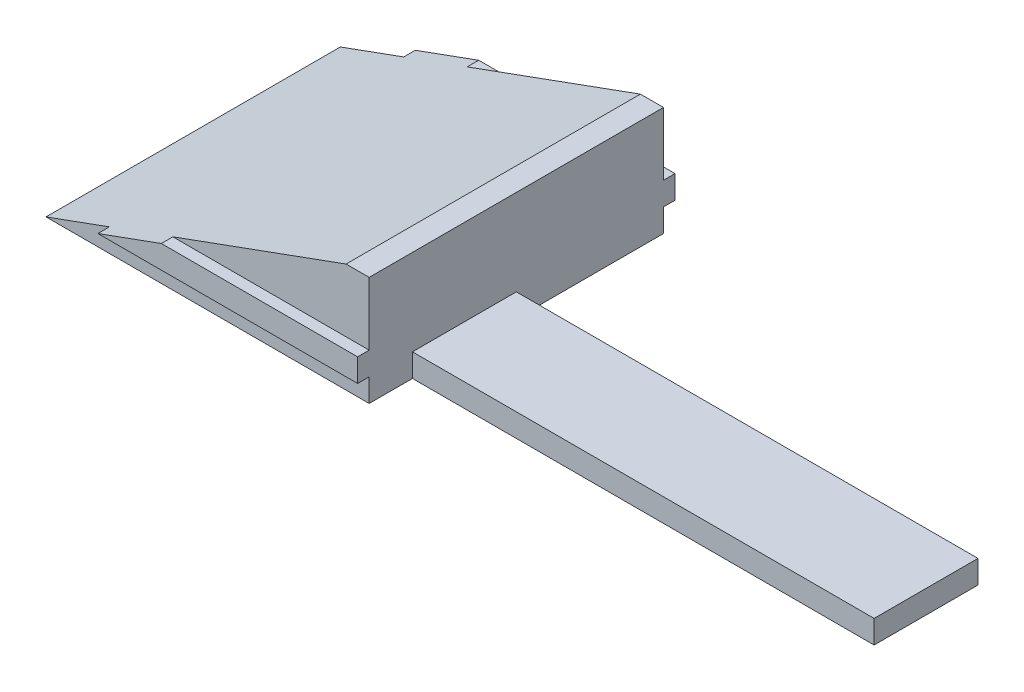
ISO-10303-21;
HEADER;
FILE_DESCRIPTION(('STEP AP214'),'2;1');
FILE_NAME('part.step','',(''),(''),'','','');
FILE_SCHEMA(('AUTOMOTIVE_DESIGN { 1 0 10303 214 1 1 1 1 }'));
ENDSEC;
DATA;
#1=APPLICATION_CONTEXT('core data for automotive mechanical design processes');
#2=APPLICATION_PROTOCOL_DEFINITION('international standard','automotive_design',2000,#1);
#3=PRODUCT_CONTEXT('',#1,'mechanical');
#4=PRODUCT('Part','Part','',(#3));
#5=PRODUCT_RELATED_PRODUCT_CATEGORY('part','',(#4));
#6=PRODUCT_DEFINITION_FORMATION('','',#4);
#7=PRODUCT_DEFINITION_CONTEXT('part definition',#1,'design');
#8=PRODUCT_DEFINITION('design','',#6,#7);
#9=PRODUCT_DEFINITION_SHAPE('','',#8);
#10=(LENGTH_UNIT() NAMED_UNIT(*) SI_UNIT(.MILLI.,.METRE.));
#11=(NAMED_UNIT(*) PLANE_ANGLE_UNIT() SI_UNIT($,.RADIAN.));
#12=(NAMED_UNIT(*) SI_UNIT($,.STERADIAN.) SOLID_ANGLE_UNIT());
#13=UNCERTAINTY_MEASURE_WITH_UNIT(LENGTH_MEASURE(1.E-05),#10,'distance_accuracy_value','');
#14=(GEOMETRIC_REPRESENTATION_CONTEXT(3) GLOBAL_UNCERTAINTY_ASSIGNED_CONTEXT((#13)) GLOBAL_UNIT_ASSIGNED_CONTEXT((#10,
#11,#12)) REPRESENTATION_CONTEXT('',''));
#15=CARTESIAN_POINT('',(0.,0.,0.));
#16=DIRECTION('',(0.,0.,1.));
#17=DIRECTION('',(1.,0.,0.));
#18=AXIS2_PLACEMENT_3D('',#15,#16,#17);
#19=CARTESIAN_POINT('',(-13.,9.463,-12.75));
#20=DIRECTION('',(0.,0.,1.));
#21=DIRECTION('',(1.,0.,0.));
#22=AXIS2_PLACEMENT_3D('',#19,#20,#21);
#23=PLANE('',#22);
#24=DIRECTION('',(1.,0.,0.));
#25=VECTOR('',#24,1.);
#26=CARTESIAN_POINT('',(13.,4.,-12.75));
#27=LINE('',#26,#25);
#28=CARTESIAN_POINT('',(-2.0100903221815,4.,-12.75));
#29=VERTEX_POINT('',#28);
#30=CARTESIAN_POINT('',(15.,4.,-12.75));
#31=VERTEX_POINT('',#30);
#32=EDGE_CURVE('E211',#29,#31,#27,.T.);
#33=ORIENTED_EDGE('',*,*,#32,.F.);
#34=DIRECTION('',(-0.939692620785908,-0.342020143325669,0.));
#35=VECTOR('',#34,1.);
#36=CARTESIAN_POINT('',(12.9993788202991,9.463,-12.75));
#37=LINE('',#36,#35);
#38=CARTESIAN_POINT('',(12.9993788202991,9.463,-12.75));
#39=VERTEX_POINT('',#38);
#40=EDGE_CURVE('E11',#29,#39,#37,.F.);
#41=ORIENTED_EDGE('',*,*,#40,.T.);
#42=DIRECTION('',(-1.,0.,0.));
#43=VECTOR('',#42,1.);
#44=CARTESIAN_POINT('',(-13.,9.463,-12.75));
#45=LINE('',#44,#43);
#46=CARTESIAN_POINT('',(15.,9.463,-12.75));
#47=VERTEX_POINT('',#46);
#48=EDGE_CURVE('E227',#47,#39,#45,.T.);
#49=ORIENTED_EDGE('',*,*,#48,.F.);
#50=DIRECTION('',(0.,1.,0.));
#51=VECTOR('',#50,1.);
#52=CARTESIAN_POINT('',(15.,4.,-12.75));
#53=LINE('',#52,#51);
#54=EDGE_CURVE('E188',#31,#47,#53,.T.);
#55=ORIENTED_EDGE('',*,*,#54,.F.);
#56=EDGE_LOOP('',(#33,#41,#49,#55));
#57=FACE_BOUND('',#56,.T.);
#58=ADVANCED_FACE('F33',(#57),#23,.F.);
#59=DIRECTION('',(-1.,0.,0.));
#60=VECTOR('',#59,1.);
#61=CARTESIAN_POINT('',(-13.,0.,-12.75));
#62=LINE('',#61,#60);
#63=CARTESIAN_POINT('',(15.,0.,-12.75));
#64=VERTEX_POINT('',#63);
#65=CARTESIAN_POINT('',(-13.,0.,-12.75));
#66=VERTEX_POINT('',#65);
#67=EDGE_CURVE('E223',#64,#66,#62,.T.);
#68=ORIENTED_EDGE('',*,*,#67,.T.);
#69=DIRECTION('',(-0.939692620785908,-0.342020143325669,0.));
#70=VECTOR('',#69,1.);
#71=CARTESIAN_POINT('',(12.9993788202991,9.463,-12.75));
#72=LINE('',#71,#70);
#73=CARTESIAN_POINT('',(-7.50504516109073,2.,-12.75));
#74=VERTEX_POINT('',#73);
#75=EDGE_CURVE('E251',#66,#74,#72,.F.);
#76=ORIENTED_EDGE('',*,*,#75,.T.);
#77=DIRECTION('',(-1.,0.,0.));
#78=VECTOR('',#77,1.);
#79=CARTESIAN_POINT('',(13.,2.,-12.75));
#80=LINE('',#79,#78);
#81=CARTESIAN_POINT('',(15.,2.,-12.75));
#82=VERTEX_POINT('',#81);
#83=EDGE_CURVE('E206',#82,#74,#80,.T.);
#84=ORIENTED_EDGE('',*,*,#83,.F.);
#85=DIRECTION('',(0.,1.,0.));
#86=VECTOR('',#85,1.);
#87=CARTESIAN_POINT('',(15.,0.,-12.75));
#88=LINE('',#87,#86);
#89=EDGE_CURVE('E176',#64,#82,#88,.T.);
#90=ORIENTED_EDGE('',*,*,#89,.F.);
#91=EDGE_LOOP('',(#68,#76,#84,#90));
#92=FACE_BOUND('',#91,.T.);
#93=ADVANCED_FACE('F322',(#92),#23,.F.);
#94=CARTESIAN_POINT('',(-13.,9.463,12.75));
#95=DIRECTION('',(0.,0.,-1.));
#96=DIRECTION('',(-1.,0.,0.));
#97=AXIS2_PLACEMENT_3D('',#94,#95,#96);
#98=PLANE('',#97);
#99=DIRECTION('',(1.,0.,0.));
#100=VECTOR('',#99,1.);
#101=CARTESIAN_POINT('',(-13.,9.463,12.75));
#102=LINE('',#101,#100);
#103=CARTESIAN_POINT('',(12.9993788202991,9.463,12.75));
#104=VERTEX_POINT('',#103);
#105=CARTESIAN_POINT('',(15.,9.463,12.75));
#106=VERTEX_POINT('',#105);
#107=EDGE_CURVE('E230',#104,#106,#102,.T.);
#108=ORIENTED_EDGE('',*,*,#107,.F.);
#109=DIRECTION('',(0.939692620785908,0.342020143325669,0.));
#110=VECTOR('',#109,1.);
#111=CARTESIAN_POINT('',(12.9993788202991,9.463,12.75));
#112=LINE('',#111,#110);
#113=CARTESIAN_POINT('',(-2.01009032218151,4.,12.75));
#114=VERTEX_POINT('',#113);
#115=EDGE_CURVE('E241',#104,#114,#112,.F.);
#116=ORIENTED_EDGE('',*,*,#115,.T.);
#117=DIRECTION('',(-1.,0.,0.));
#118=VECTOR('',#117,1.);
#119=CARTESIAN_POINT('',(-13.,4.,12.75));
#120=LINE('',#119,#118);
#121=CARTESIAN_POINT('',(15.,4.,12.75));
#122=VERTEX_POINT('',#121);
#123=EDGE_CURVE('E213',#122,#114,#120,.T.);
#124=ORIENTED_EDGE('',*,*,#123,.F.);
#125=DIRECTION('',(0.,-1.,0.));
#126=VECTOR('',#125,1.);
#127=CARTESIAN_POINT('',(15.,9.463,12.75));
#128=LINE('',#127,#126);
#129=EDGE_CURVE('E194',#106,#122,#128,.T.);
#130=ORIENTED_EDGE('',*,*,#129,.F.);
#131=EDGE_LOOP('',(#108,#116,#124,#130));
#132=FACE_BOUND('',#131,.T.);
#133=ADVANCED_FACE('F276',(#132),#98,.F.);
#134=DIRECTION('',(1.,0.,0.));
#135=VECTOR('',#134,1.);
#136=CARTESIAN_POINT('',(-13.,2.,12.75));
#137=LINE('',#136,#135);
#138=CARTESIAN_POINT('',(-7.50504516109074,2.,12.75));
#139=VERTEX_POINT('',#138);
#140=CARTESIAN_POINT('',(15.,2.,12.75));
#141=VERTEX_POINT('',#140);
#142=EDGE_CURVE('E221',#139,#141,#137,.T.);
#143=ORIENTED_EDGE('',*,*,#142,.F.);
#144=DIRECTION('',(0.939692620785908,0.342020143325669,0.));
#145=VECTOR('',#144,1.);
#146=CARTESIAN_POINT('',(12.9993788202991,9.463,12.75));
#147=LINE('',#146,#145);
#148=CARTESIAN_POINT('',(-13.,0.,12.75));
#149=VERTEX_POINT('',#148);
#150=EDGE_CURVE('E249',#139,#149,#147,.F.);
#151=ORIENTED_EDGE('',*,*,#150,.T.);
#152=DIRECTION('',(1.,0.,0.));
#153=VECTOR('',#152,1.);
#154=CARTESIAN_POINT('',(-13.,0.,12.75));
#155=LINE('',#154,#153);
#156=CARTESIAN_POINT('',(15.,0.,12.75));
#157=VERTEX_POINT('',#156);
#158=EDGE_CURVE('E231',#149,#157,#155,.T.);
#159=ORIENTED_EDGE('',*,*,#158,.T.);
#160=DIRECTION('',(0.,-1.,0.));
#161=VECTOR('',#160,1.);
#162=CARTESIAN_POINT('',(15.,2.,12.75));
#163=LINE('',#162,#161);
#164=EDGE_CURVE('E165',#141,#157,#163,.T.);
#165=ORIENTED_EDGE('',*,*,#164,.F.);
#166=EDGE_LOOP('',(#143,#151,#159,#165));
#167=FACE_BOUND('',#166,.T.);
#168=ADVANCED_FACE('F294',(#167),#98,.F.);
#169=CARTESIAN_POINT('',(0.,9.463,0.));
#170=DIRECTION('',(0.,-1.,0.));
#171=DIRECTION('',(0.,0.,-1.));
#172=AXIS2_PLACEMENT_3D('',#169,#170,#171);
#173=PLANE('',#172);
#174=ORIENTED_EDGE('',*,*,#48,.T.);
#175=DIRECTION('',(0.,0.,1.));
#176=VECTOR('',#175,1.);
#177=CARTESIAN_POINT('',(12.9993788202991,9.463,0.));
#178=LINE('',#177,#176);
#179=EDGE_CURVE('E233',#39,#104,#178,.T.);
#180=ORIENTED_EDGE('',*,*,#179,.T.);
#181=ORIENTED_EDGE('',*,*,#107,.T.);
#182=DIRECTION('',(0.,0.,1.));
#183=VECTOR('',#182,1.);
#184=CARTESIAN_POINT('',(15.,9.463,-12.75));
#185=LINE('',#184,#183);
#186=EDGE_CURVE('E191',#47,#106,#185,.T.);
#187=ORIENTED_EDGE('',*,*,#186,.F.);
#188=EDGE_LOOP('',(#174,#180,#181,#187));
#189=FACE_BOUND('',#188,.T.);
#190=ADVANCED_FACE('F272',(#189),#173,.F.);
#191=CARTESIAN_POINT('',(0.,0.,0.));
#192=DIRECTION('',(0.,-1.,0.));
#193=DIRECTION('',(0.,0.,-1.));
#194=AXIS2_PLACEMENT_3D('',#191,#192,#193);
#195=PLANE('',#194);
#196=ORIENTED_EDGE('',*,*,#67,.F.);
#197=DIRECTION('',(0.,0.,-1.));
#198=VECTOR('',#197,1.);
#199=CARTESIAN_POINT('',(15.,0.,12.75));
#200=LINE('',#199,#198);
#201=CARTESIAN_POINT('',(15.,0.,0.));
#202=VERTEX_POINT('',#201);
#203=EDGE_CURVE('E168',#202,#64,#200,.T.);
#204=ORIENTED_EDGE('',*,*,#203,.F.);
#205=DIRECTION('',(-1.,0.,0.));
#206=VECTOR('',#205,1.);
#207=CARTESIAN_POINT('',(55.,0.,0.));
#208=LINE('',#207,#206);
#209=CARTESIAN_POINT('',(55.,0.,0.));
#210=VERTEX_POINT('',#209);
#211=EDGE_CURVE('E306',#210,#202,#208,.T.);
#212=ORIENTED_EDGE('',*,*,#211,.F.);
#213=DIRECTION('',(0.,0.,-1.));
#214=VECTOR('',#213,1.);
#215=CARTESIAN_POINT('',(55.,0.,0.));
#216=LINE('',#215,#214);
#217=CARTESIAN_POINT('',(55.,0.,9.));
#218=VERTEX_POINT('',#217);
#219=EDGE_CURVE('E158',#218,#210,#216,.T.);
#220=ORIENTED_EDGE('',*,*,#219,.F.);
#221=DIRECTION('',(-1.,0.,0.));
#222=VECTOR('',#221,1.);
#223=CARTESIAN_POINT('',(55.,0.,9.));
#224=LINE('',#223,#222);
#225=CARTESIAN_POINT('',(15.,0.,9.));
#226=VERTEX_POINT('',#225);
#227=EDGE_CURVE('E170',#218,#226,#224,.T.);
#228=ORIENTED_EDGE('',*,*,#227,.T.);
#229=EDGE_CURVE('E174',#157,#226,#200,.T.);
#230=ORIENTED_EDGE('',*,*,#229,.F.);
#231=ORIENTED_EDGE('',*,*,#158,.F.);
#232=DIRECTION('',(0.,0.,1.));
#233=VECTOR('',#232,1.);
#234=CARTESIAN_POINT('',(-13.,0.,12.75));
#235=LINE('',#234,#233);
#236=EDGE_CURVE('E235',#66,#149,#235,.T.);
#237=ORIENTED_EDGE('',*,*,#236,.F.);
#238=EDGE_LOOP('',(#196,#204,#212,#220,#228,#230,#231,#237));
#239=FACE_BOUND('',#238,.T.);
#240=ADVANCED_FACE('F305',(#239),#195,.T.);
#241=CARTESIAN_POINT('',(-13.,4.,13.75));
#242=DIRECTION('',(0.,-1.,0.));
#243=DIRECTION('',(0.,0.,-1.));
#244=AXIS2_PLACEMENT_3D('',#241,#242,#243);
#245=PLANE('',#244);
#246=ORIENTED_EDGE('',*,*,#123,.T.);
#247=DIRECTION('',(0.,0.,-1.));
#248=VECTOR('',#247,1.);
#249=CARTESIAN_POINT('',(-2.0100903221815,4.,0.));
#250=LINE('',#249,#248);
#251=CARTESIAN_POINT('',(-2.01009032218151,4.,13.75));
#252=VERTEX_POINT('',#251);
#253=EDGE_CURVE('E243',#114,#252,#250,.F.);
#254=ORIENTED_EDGE('',*,*,#253,.T.);
#255=DIRECTION('',(-1.,0.,0.));
#256=VECTOR('',#255,1.);
#257=CARTESIAN_POINT('',(-13.,4.,13.75));
#258=LINE('',#257,#256);
#259=CARTESIAN_POINT('',(15.,4.,13.75));
#260=VERTEX_POINT('',#259);
#261=EDGE_CURVE('E217',#260,#252,#258,.T.);
#262=ORIENTED_EDGE('',*,*,#261,.F.);
#263=DIRECTION('',(0.,0.,1.));
#264=VECTOR('',#263,1.);
#265=CARTESIAN_POINT('',(15.,4.,12.75));
#266=LINE('',#265,#264);
#267=EDGE_CURVE('E197',#122,#260,#266,.T.);
#268=ORIENTED_EDGE('',*,*,#267,.F.);
#269=EDGE_LOOP('',(#246,#254,#262,#268));
#270=FACE_BOUND('',#269,.T.);
#271=ADVANCED_FACE('F281',(#270),#245,.F.);
#272=CARTESIAN_POINT('',(-13.,2.,13.75));
#273=DIRECTION('',(0.,1.,0.));
#274=DIRECTION('',(0.,0.,1.));
#275=AXIS2_PLACEMENT_3D('',#272,#273,#274);
#276=PLANE('',#275);
#277=DIRECTION('',(1.,0.,0.));
#278=VECTOR('',#277,1.);
#279=CARTESIAN_POINT('',(-13.,2.,13.75));
#280=LINE('',#279,#278);
#281=CARTESIAN_POINT('',(-7.50504516109074,2.,13.75));
#282=VERTEX_POINT('',#281);
#283=CARTESIAN_POINT('',(15.,2.,13.75));
#284=VERTEX_POINT('',#283);
#285=EDGE_CURVE('E220',#282,#284,#280,.T.);
#286=ORIENTED_EDGE('',*,*,#285,.F.);
#287=DIRECTION('',(0.,0.,1.));
#288=VECTOR('',#287,1.);
#289=CARTESIAN_POINT('',(-7.50504516109074,2.,0.));
#290=LINE('',#289,#288);
#291=EDGE_CURVE('E247',#282,#139,#290,.F.);
#292=ORIENTED_EDGE('',*,*,#291,.T.);
#293=ORIENTED_EDGE('',*,*,#142,.T.);
#294=DIRECTION('',(0.,0.,-1.));
#295=VECTOR('',#294,1.);
#296=CARTESIAN_POINT('',(15.,2.,13.75));
#297=LINE('',#296,#295);
#298=EDGE_CURVE('E203',#284,#141,#297,.T.);
#299=ORIENTED_EDGE('',*,*,#298,.F.);
#300=EDGE_LOOP('',(#286,#292,#293,#299));
#301=FACE_BOUND('',#300,.T.);
#302=ADVANCED_FACE('F290',(#301),#276,.F.);
#303=CARTESIAN_POINT('',(0.,0.,13.75));
#304=DIRECTION('',(0.,0.,1.));
#305=DIRECTION('',(1.,0.,0.));
#306=AXIS2_PLACEMENT_3D('',#303,#304,#305);
#307=PLANE('',#306);
#308=ORIENTED_EDGE('',*,*,#261,.T.);
#309=DIRECTION('',(0.939692620785908,0.342020143325669,0.));
#310=VECTOR('',#309,1.);
#311=CARTESIAN_POINT('',(-1.52071111972664,4.1781194629625,13.75));
#312=LINE('',#311,#310);
#313=EDGE_CURVE('E245',#252,#282,#312,.F.);
#314=ORIENTED_EDGE('',*,*,#313,.T.);
#315=ORIENTED_EDGE('',*,*,#285,.T.);
#316=DIRECTION('',(0.,-1.,0.));
#317=VECTOR('',#316,1.);
#318=CARTESIAN_POINT('',(15.,4.,13.75));
#319=LINE('',#318,#317);
#320=EDGE_CURVE('E200',#260,#284,#319,.T.);
#321=ORIENTED_EDGE('',*,*,#320,.F.);
#322=EDGE_LOOP('',(#308,#314,#315,#321));
#323=FACE_BOUND('',#322,.T.);
#324=ADVANCED_FACE('F284',(#323),#307,.T.);
#325=CARTESIAN_POINT('',(13.,2.,-13.75));
#326=DIRECTION('',(0.,1.,0.));
#327=DIRECTION('',(0.,0.,1.));
#328=AXIS2_PLACEMENT_3D('',#325,#326,#327);
#329=PLANE('',#328);
#330=ORIENTED_EDGE('',*,*,#83,.T.);
#331=DIRECTION('',(0.,0.,1.));
#332=VECTOR('',#331,1.);
#333=CARTESIAN_POINT('',(-7.50504516109074,2.,0.));
#334=LINE('',#333,#332);
#335=CARTESIAN_POINT('',(-7.50504516109073,2.,-13.75));
#336=VERTEX_POINT('',#335);
#337=EDGE_CURVE('E253',#74,#336,#334,.F.);
#338=ORIENTED_EDGE('',*,*,#337,.T.);
#339=DIRECTION('',(-1.,0.,0.));
#340=VECTOR('',#339,1.);
#341=CARTESIAN_POINT('',(13.,2.,-13.75));
#342=LINE('',#341,#340);
#343=CARTESIAN_POINT('',(15.,2.,-13.75));
#344=VERTEX_POINT('',#343);
#345=EDGE_CURVE('E207',#344,#336,#342,.T.);
#346=ORIENTED_EDGE('',*,*,#345,.F.);
#347=DIRECTION('',(0.,0.,-1.));
#348=VECTOR('',#347,1.);
#349=CARTESIAN_POINT('',(15.,2.,-12.75));
#350=LINE('',#349,#348);
#351=EDGE_CURVE('E179',#82,#344,#350,.T.);
#352=ORIENTED_EDGE('',*,*,#351,.F.);
#353=EDGE_LOOP('',(#330,#338,#346,#352));
#354=FACE_BOUND('',#353,.T.);
#355=ADVANCED_FACE('F318',(#354),#329,.F.);
#356=CARTESIAN_POINT('',(13.,4.,-13.75));
#357=DIRECTION('',(0.,-1.,0.));
#358=DIRECTION('',(0.,0.,-1.));
#359=AXIS2_PLACEMENT_3D('',#356,#357,#358);
#360=PLANE('',#359);
#361=DIRECTION('',(1.,0.,0.));
#362=VECTOR('',#361,1.);
#363=CARTESIAN_POINT('',(13.,4.,-13.75));
#364=LINE('',#363,#362);
#365=CARTESIAN_POINT('',(-2.0100903221815,4.,-13.75));
#366=VERTEX_POINT('',#365);
#367=CARTESIAN_POINT('',(15.,4.,-13.75));
#368=VERTEX_POINT('',#367);
#369=EDGE_CURVE('E210',#366,#368,#364,.T.);
#370=ORIENTED_EDGE('',*,*,#369,.F.);
#371=DIRECTION('',(0.,0.,-1.));
#372=VECTOR('',#371,1.);
#373=CARTESIAN_POINT('',(-2.0100903221815,4.,0.));
#374=LINE('',#373,#372);
#375=EDGE_CURVE('E41',#366,#29,#374,.F.);
#376=ORIENTED_EDGE('',*,*,#375,.T.);
#377=ORIENTED_EDGE('',*,*,#32,.T.);
#378=DIRECTION('',(0.,0.,1.));
#379=VECTOR('',#378,1.);
#380=CARTESIAN_POINT('',(15.,4.,-13.75));
#381=LINE('',#380,#379);
#382=EDGE_CURVE('E185',#368,#31,#381,.T.);
#383=ORIENTED_EDGE('',*,*,#382,.F.);
#384=EDGE_LOOP('',(#370,#376,#377,#383));
#385=FACE_BOUND('',#384,.T.);
#386=ADVANCED_FACE('F260',(#385),#360,.F.);
#387=CARTESIAN_POINT('',(0.,0.,-13.75));
#388=DIRECTION('',(0.,0.,-1.));
#389=DIRECTION('',(-1.,0.,0.));
#390=AXIS2_PLACEMENT_3D('',#387,#388,#389);
#391=PLANE('',#390);
#392=ORIENTED_EDGE('',*,*,#345,.T.);
#393=DIRECTION('',(-0.939692620785908,-0.342020143325669,0.));
#394=VECTOR('',#393,1.);
#395=CARTESIAN_POINT('',(-1.52071111972664,4.1781194629625,-13.75));
#396=LINE('',#395,#394);
#397=EDGE_CURVE('E255',#336,#366,#396,.F.);
#398=ORIENTED_EDGE('',*,*,#397,.T.);
#399=ORIENTED_EDGE('',*,*,#369,.T.);
#400=DIRECTION('',(0.,1.,0.));
#401=VECTOR('',#400,1.);
#402=CARTESIAN_POINT('',(15.,2.,-13.75));
#403=LINE('',#402,#401);
#404=EDGE_CURVE('E182',#344,#368,#403,.T.);
#405=ORIENTED_EDGE('',*,*,#404,.F.);
#406=EDGE_LOOP('',(#392,#398,#399,#405));
#407=FACE_BOUND('',#406,.T.);
#408=ADVANCED_FACE('F321',(#407),#391,.T.);
#409=CARTESIAN_POINT('',(12.9993788202991,9.463,0.));
#410=DIRECTION('',(0.342020143325669,-0.939692620785908,0.));
#411=DIRECTION('',(0.,0.,1.));
#412=AXIS2_PLACEMENT_3D('',#409,#410,#411);
#413=PLANE('',#412);
#414=ORIENTED_EDGE('',*,*,#75,.F.);
#415=ORIENTED_EDGE('',*,*,#236,.T.);
#416=ORIENTED_EDGE('',*,*,#150,.F.);
#417=ORIENTED_EDGE('',*,*,#291,.F.);
#418=ORIENTED_EDGE('',*,*,#313,.F.);
#419=ORIENTED_EDGE('',*,*,#253,.F.);
#420=ORIENTED_EDGE('',*,*,#115,.F.);
#421=ORIENTED_EDGE('',*,*,#179,.F.);
#422=ORIENTED_EDGE('',*,*,#40,.F.);
#423=ORIENTED_EDGE('',*,*,#375,.F.);
#424=ORIENTED_EDGE('',*,*,#397,.F.);
#425=ORIENTED_EDGE('',*,*,#337,.F.);
#426=EDGE_LOOP('',(#414,#415,#416,#417,#418,#419,#420,#421,#422,#423,#424,#425));
#427=FACE_BOUND('',#426,.T.);
#428=ADVANCED_FACE('F35',(#427),#413,.F.);
#429=CARTESIAN_POINT('',(15.,0.,0.));
#430=DIRECTION('',(1.,0.,0.));
#431=DIRECTION('',(0.,0.,-1.));
#432=AXIS2_PLACEMENT_3D('',#429,#430,#431);
#433=PLANE('',#432);
#434=DIRECTION('',(0.,1.,0.));
#435=VECTOR('',#434,1.);
#436=CARTESIAN_POINT('',(15.,0.,0.));
#437=LINE('',#436,#435);
#438=CARTESIAN_POINT('',(15.,2.,0.));
#439=VERTEX_POINT('',#438);
#440=EDGE_CURVE('E53',#202,#439,#437,.T.);
#441=ORIENTED_EDGE('',*,*,#440,.F.);
#442=ORIENTED_EDGE('',*,*,#203,.T.);
#443=ORIENTED_EDGE('',*,*,#89,.T.);
#444=ORIENTED_EDGE('',*,*,#351,.T.);
#445=ORIENTED_EDGE('',*,*,#404,.T.);
#446=ORIENTED_EDGE('',*,*,#382,.T.);
#447=ORIENTED_EDGE('',*,*,#54,.T.);
#448=ORIENTED_EDGE('',*,*,#186,.T.);
#449=ORIENTED_EDGE('',*,*,#129,.T.);
#450=ORIENTED_EDGE('',*,*,#267,.T.);
#451=ORIENTED_EDGE('',*,*,#320,.T.);
#452=ORIENTED_EDGE('',*,*,#298,.T.);
#453=ORIENTED_EDGE('',*,*,#164,.T.);
#454=ORIENTED_EDGE('',*,*,#229,.T.);
#455=DIRECTION('',(0.,-1.,0.));
#456=VECTOR('',#455,1.);
#457=CARTESIAN_POINT('',(15.,0.,9.));
#458=LINE('',#457,#456);
#459=CARTESIAN_POINT('',(15.,2.,9.));
#460=VERTEX_POINT('',#459);
#461=EDGE_CURVE('E162',#460,#226,#458,.T.);
#462=ORIENTED_EDGE('',*,*,#461,.F.);
#463=DIRECTION('',(0.,0.,1.));
#464=VECTOR('',#463,1.);
#465=CARTESIAN_POINT('',(15.,2.,0.));
#466=LINE('',#465,#464);
#467=EDGE_CURVE('E48',#439,#460,#466,.T.);
#468=ORIENTED_EDGE('',*,*,#467,.F.);
#469=EDGE_LOOP('',(#441,#442,#443,#444,#445,#446,#447,#448,#449,#450,#451,#452,#453,#454,#462,#468));
#470=FACE_BOUND('',#469,.T.);
#471=ADVANCED_FACE('F278',(#470),#433,.T.);
#472=CARTESIAN_POINT('',(55.,0.,0.));
#473=DIRECTION('',(0.,0.,1.));
#474=DIRECTION('',(0.,-1.,0.));
#475=AXIS2_PLACEMENT_3D('',#472,#473,#474);
#476=PLANE('',#475);
#477=ORIENTED_EDGE('',*,*,#440,.T.);
#478=DIRECTION('',(-1.,0.,0.));
#479=VECTOR('',#478,1.);
#480=CARTESIAN_POINT('',(55.,2.,0.));
#481=LINE('',#480,#479);
#482=CARTESIAN_POINT('',(55.,2.,0.));
#483=VERTEX_POINT('',#482);
#484=EDGE_CURVE('E147',#483,#439,#481,.T.);
#485=ORIENTED_EDGE('',*,*,#484,.F.);
#486=DIRECTION('',(0.,1.,0.));
#487=VECTOR('',#486,1.);
#488=CARTESIAN_POINT('',(55.,0.,0.));
#489=LINE('',#488,#487);
#490=EDGE_CURVE('E153',#210,#483,#489,.T.);
#491=ORIENTED_EDGE('',*,*,#490,.F.);
#492=ORIENTED_EDGE('',*,*,#211,.T.);
#493=EDGE_LOOP('',(#477,#485,#491,#492));
#494=FACE_BOUND('',#493,.T.);
#495=ADVANCED_FACE('F164',(#494),#476,.F.);
#496=CARTESIAN_POINT('',(55.,2.,0.));
#497=DIRECTION('',(0.,-1.,0.));
#498=DIRECTION('',(0.,0.,-1.));
#499=AXIS2_PLACEMENT_3D('',#496,#497,#498);
#500=PLANE('',#499);
#501=ORIENTED_EDGE('',*,*,#467,.T.);
#502=DIRECTION('',(-1.,0.,0.));
#503=VECTOR('',#502,1.);
#504=CARTESIAN_POINT('',(55.,2.,9.));
#505=LINE('',#504,#503);
#506=CARTESIAN_POINT('',(55.,2.,9.));
#507=VERTEX_POINT('',#506);
#508=EDGE_CURVE('E149',#507,#460,#505,.T.);
#509=ORIENTED_EDGE('',*,*,#508,.F.);
#510=DIRECTION('',(0.,0.,1.));
#511=VECTOR('',#510,1.);
#512=CARTESIAN_POINT('',(55.,2.,0.));
#513=LINE('',#512,#511);
#514=EDGE_CURVE('E143',#483,#507,#513,.T.);
#515=ORIENTED_EDGE('',*,*,#514,.F.);
#516=ORIENTED_EDGE('',*,*,#484,.T.);
#517=EDGE_LOOP('',(#501,#509,#515,#516));
#518=FACE_BOUND('',#517,.T.);
#519=ADVANCED_FACE('F145',(#518),#500,.F.);
#520=CARTESIAN_POINT('',(55.,0.,9.));
#521=DIRECTION('',(0.,0.,-1.));
#522=DIRECTION('',(-1.,0.,0.));
#523=AXIS2_PLACEMENT_3D('',#520,#521,#522);
#524=PLANE('',#523);
#525=ORIENTED_EDGE('',*,*,#461,.T.);
#526=ORIENTED_EDGE('',*,*,#227,.F.);
#527=DIRECTION('',(0.,-1.,0.));
#528=VECTOR('',#527,1.);
#529=CARTESIAN_POINT('',(55.,0.,9.));
#530=LINE('',#529,#528);
#531=EDGE_CURVE('E152',#507,#218,#530,.T.);
#532=ORIENTED_EDGE('',*,*,#531,.F.);
#533=ORIENTED_EDGE('',*,*,#508,.T.);
#534=EDGE_LOOP('',(#525,#526,#532,#533));
#535=FACE_BOUND('',#534,.T.);
#536=ADVANCED_FACE('F302',(#535),#524,.F.);
#537=CARTESIAN_POINT('',(55.,0.,0.));
#538=DIRECTION('',(1.,0.,0.));
#539=DIRECTION('',(0.,0.,-1.));
#540=AXIS2_PLACEMENT_3D('',#537,#538,#539);
#541=PLANE('',#540);
#542=ORIENTED_EDGE('',*,*,#490,.T.);
#543=ORIENTED_EDGE('',*,*,#514,.T.);
#544=ORIENTED_EDGE('',*,*,#531,.T.);
#545=ORIENTED_EDGE('',*,*,#219,.T.);
#546=EDGE_LOOP('',(#542,#543,#544,#545));
#547=FACE_BOUND('',#546,.T.);
#548=ADVANCED_FACE('F156',(#547),#541,.T.);
#549=CLOSED_SHELL('',(#58,#93,#133,#168,#190,#240,#271,#302,#324,#355,#386,#408,#428,#471,#495,
#519,#536,#548));
#550=MANIFOLD_SOLID_BREP('B2',#549);
#551=ADVANCED_BREP_SHAPE_REPRESENTATION('',(#18,#550),#14);
#552=SHAPE_DEFINITION_REPRESENTATION(#9,#551);
ENDSEC;
END-ISO-10303-21;
